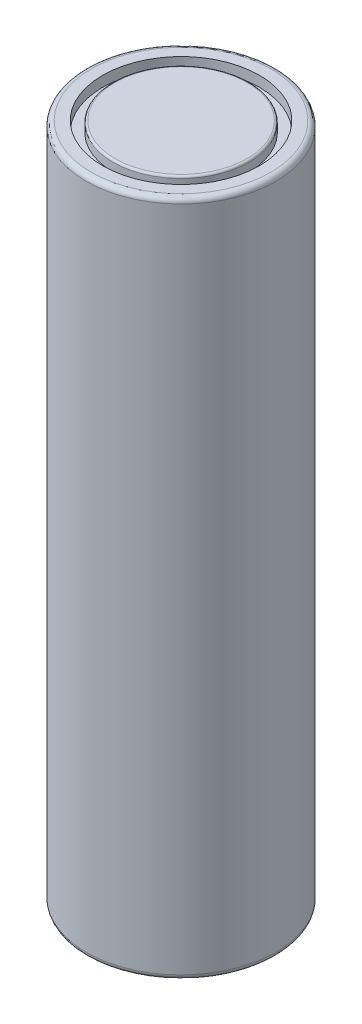
ISO-10303-21;
HEADER;
FILE_DESCRIPTION(('STEP AP214'),'2;1');
FILE_NAME('part.step','',(''),(''),'','','');
FILE_SCHEMA(('AUTOMOTIVE_DESIGN { 1 0 10303 214 1 1 1 1 }'));
ENDSEC;
DATA;
#1=APPLICATION_CONTEXT('core data for automotive mechanical design processes');
#2=APPLICATION_PROTOCOL_DEFINITION('international standard','automotive_design',2000,#1);
#3=PRODUCT_CONTEXT('',#1,'mechanical');
#4=PRODUCT('Part','Part','',(#3));
#5=PRODUCT_RELATED_PRODUCT_CATEGORY('part','',(#4));
#6=PRODUCT_DEFINITION_FORMATION('','',#4);
#7=PRODUCT_DEFINITION_CONTEXT('part definition',#1,'design');
#8=PRODUCT_DEFINITION('design','',#6,#7);
#9=PRODUCT_DEFINITION_SHAPE('','',#8);
#10=(LENGTH_UNIT() NAMED_UNIT(*) SI_UNIT(.MILLI.,.METRE.));
#11=(NAMED_UNIT(*) PLANE_ANGLE_UNIT() SI_UNIT($,.RADIAN.));
#12=(NAMED_UNIT(*) SI_UNIT($,.STERADIAN.) SOLID_ANGLE_UNIT());
#13=UNCERTAINTY_MEASURE_WITH_UNIT(LENGTH_MEASURE(1.E-05),#10,'distance_accuracy_value','');
#14=(GEOMETRIC_REPRESENTATION_CONTEXT(3) GLOBAL_UNCERTAINTY_ASSIGNED_CONTEXT((#13)) GLOBAL_UNIT_ASSIGNED_CONTEXT((#10,
#11,#12)) REPRESENTATION_CONTEXT('',''));
#15=CARTESIAN_POINT('',(0.,0.,0.));
#16=DIRECTION('',(0.,0.,1.));
#17=DIRECTION('',(1.,0.,0.));
#18=AXIS2_PLACEMENT_3D('',#15,#16,#17);
#19=CARTESIAN_POINT('',(0.,65.,0.));
#20=DIRECTION('',(0.,-1.,0.));
#21=DIRECTION('',(0.,0.,-1.));
#22=AXIS2_PLACEMENT_3D('',#19,#20,#21);
#23=CYLINDRICAL_SURFACE('',#22,9.1);
#24=CARTESIAN_POINT('',(0.,0.5,0.));
#25=DIRECTION('',(0.,1.,0.));
#26=DIRECTION('',(0.,0.,1.));
#27=AXIS2_PLACEMENT_3D('',#24,#25,#26);
#28=CIRCLE('',#27,9.1);
#29=CARTESIAN_POINT('',(0.,0.5,9.10000000000002));
#30=VERTEX_POINT('',#29);
#31=EDGE_CURVE('E99',#30,#30,#28,.T.);
#32=ORIENTED_EDGE('',*,*,#31,.T.);
#33=EDGE_LOOP('',(#32));
#34=FACE_BOUND('',#33,.T.);
#35=CARTESIAN_POINT('',(0.,64.5,0.));
#36=DIRECTION('',(0.,1.,0.));
#37=DIRECTION('',(0.,0.,1.));
#38=AXIS2_PLACEMENT_3D('',#35,#36,#37);
#39=CIRCLE('',#38,9.1);
#40=CARTESIAN_POINT('',(0.,64.5,9.10000000000002));
#41=VERTEX_POINT('',#40);
#42=EDGE_CURVE('E103',#41,#41,#39,.F.);
#43=ORIENTED_EDGE('',*,*,#42,.T.);
#44=EDGE_LOOP('',(#43));
#45=FACE_BOUND('',#44,.T.);
#46=ADVANCED_FACE('F63',(#34,#45),#23,.T.);
#47=CARTESIAN_POINT('',(0.,65.,0.));
#48=DIRECTION('',(0.,1.,0.));
#49=DIRECTION('',(0.,0.,1.));
#50=AXIS2_PLACEMENT_3D('',#47,#48,#49);
#51=PLANE('',#50);
#52=CARTESIAN_POINT('',(0.,65.,0.));
#53=DIRECTION('',(0.,1.,0.));
#54=DIRECTION('',(0.,0.,1.));
#55=AXIS2_PLACEMENT_3D('',#52,#53,#54);
#56=CIRCLE('',#55,8.6);
#57=CARTESIAN_POINT('',(0.,65.,8.60000000000002));
#58=VERTEX_POINT('',#57);
#59=EDGE_CURVE('E91',#58,#58,#56,.T.);
#60=ORIENTED_EDGE('',*,*,#59,.T.);
#61=EDGE_LOOP('',(#60));
#62=FACE_BOUND('',#61,.T.);
#63=CARTESIAN_POINT('',(0.,65.,0.));
#64=DIRECTION('',(0.,1.,0.));
#65=DIRECTION('',(0.,0.,1.));
#66=AXIS2_PLACEMENT_3D('',#63,#64,#65);
#67=CIRCLE('',#66,7.51581654783285);
#68=CARTESIAN_POINT('',(0.,65.,7.51581654783286));
#69=VERTEX_POINT('',#68);
#70=EDGE_CURVE('E108',#69,#69,#67,.T.);
#71=ORIENTED_EDGE('',*,*,#70,.F.);
#72=EDGE_LOOP('',(#71));
#73=FACE_BOUND('',#72,.T.);
#74=ADVANCED_FACE('F153',(#62,#73),#51,.T.);
#75=CARTESIAN_POINT('',(0.,0.,0.));
#76=DIRECTION('',(0.,1.,0.));
#77=DIRECTION('',(0.,0.,1.));
#78=AXIS2_PLACEMENT_3D('',#75,#76,#77);
#79=PLANE('',#78);
#80=CARTESIAN_POINT('',(0.,0.,0.));
#81=DIRECTION('',(0.,-1.,0.));
#82=DIRECTION('',(0.,0.,-1.));
#83=AXIS2_PLACEMENT_3D('',#80,#81,#82);
#84=CIRCLE('',#83,7.51581654783285);
#85=CARTESIAN_POINT('',(0.,0.,-7.51581654783286));
#86=VERTEX_POINT('',#85);
#87=EDGE_CURVE('E120',#86,#86,#84,.T.);
#88=ORIENTED_EDGE('',*,*,#87,.F.);
#89=EDGE_LOOP('',(#88));
#90=FACE_BOUND('',#89,.T.);
#91=CARTESIAN_POINT('',(0.,0.,0.));
#92=DIRECTION('',(0.,1.,0.));
#93=DIRECTION('',(0.,0.,1.));
#94=AXIS2_PLACEMENT_3D('',#91,#92,#93);
#95=CIRCLE('',#94,8.6);
#96=CARTESIAN_POINT('',(0.,0.,8.60000000000002));
#97=VERTEX_POINT('',#96);
#98=EDGE_CURVE('E95',#97,#97,#95,.F.);
#99=ORIENTED_EDGE('',*,*,#98,.T.);
#100=EDGE_LOOP('',(#99));
#101=FACE_BOUND('',#100,.T.);
#102=ADVANCED_FACE('F149',(#90,#101),#79,.F.);
#103=CARTESIAN_POINT('',(0.,64.,0.));
#104=DIRECTION('',(0.,1.,0.));
#105=DIRECTION('',(0.,0.,1.));
#106=AXIS2_PLACEMENT_3D('',#103,#104,#105);
#107=CYLINDRICAL_SURFACE('',#106,7.51581654783285);
#108=CARTESIAN_POINT('',(0.,64.,0.));
#109=DIRECTION('',(0.,1.,0.));
#110=DIRECTION('',(0.,0.,1.));
#111=AXIS2_PLACEMENT_3D('',#108,#109,#110);
#112=CIRCLE('',#111,7.51581654783285);
#113=CARTESIAN_POINT('',(0.,64.,7.51581654783286));
#114=VERTEX_POINT('',#113);
#115=EDGE_CURVE('E107',#114,#114,#112,.T.);
#116=ORIENTED_EDGE('',*,*,#115,.F.);
#117=EDGE_LOOP('',(#116));
#118=FACE_BOUND('',#117,.T.);
#119=ORIENTED_EDGE('',*,*,#70,.T.);
#120=EDGE_LOOP('',(#119));
#121=FACE_BOUND('',#120,.T.);
#122=ADVANCED_FACE('F152',(#118,#121),#107,.F.);
#123=CARTESIAN_POINT('',(0.,64.,0.));
#124=DIRECTION('',(0.,1.,0.));
#125=DIRECTION('',(0.,0.,1.));
#126=AXIS2_PLACEMENT_3D('',#123,#124,#125);
#127=PLANE('',#126);
#128=CARTESIAN_POINT('',(0.,64.,0.));
#129=DIRECTION('',(0.,1.,0.));
#130=DIRECTION('',(0.,0.,1.));
#131=AXIS2_PLACEMENT_3D('',#128,#129,#130);
#132=CIRCLE('',#131,6.52806202223023);
#133=CARTESIAN_POINT('',(0.,64.,6.52806202223024));
#134=VERTEX_POINT('',#133);
#135=EDGE_CURVE('E112',#134,#134,#132,.T.);
#136=ORIENTED_EDGE('',*,*,#135,.F.);
#137=EDGE_LOOP('',(#136));
#138=FACE_BOUND('',#137,.T.);
#139=ORIENTED_EDGE('',*,*,#115,.T.);
#140=EDGE_LOOP('',(#139));
#141=FACE_BOUND('',#140,.T.);
#142=ADVANCED_FACE('F181',(#138,#141),#127,.T.);
#143=CARTESIAN_POINT('',(0.,64.,0.));
#144=DIRECTION('',(0.,1.,0.));
#145=DIRECTION('',(0.,0.,1.));
#146=AXIS2_PLACEMENT_3D('',#143,#144,#145);
#147=CYLINDRICAL_SURFACE('',#146,6.52806202223023);
#148=CARTESIAN_POINT('',(0.,64.8,0.));
#149=DIRECTION('',(0.,1.,0.));
#150=DIRECTION('',(0.,0.,1.));
#151=AXIS2_PLACEMENT_3D('',#148,#149,#150);
#152=CIRCLE('',#151,6.52806202223023);
#153=CARTESIAN_POINT('',(0.,64.8,6.52806202223024));
#154=VERTEX_POINT('',#153);
#155=EDGE_CURVE('E12',#154,#154,#152,.F.);
#156=ORIENTED_EDGE('',*,*,#155,.T.);
#157=EDGE_LOOP('',(#156));
#158=FACE_BOUND('',#157,.T.);
#159=ORIENTED_EDGE('',*,*,#135,.T.);
#160=EDGE_LOOP('',(#159));
#161=FACE_BOUND('',#160,.T.);
#162=ADVANCED_FACE('F187',(#158,#161),#147,.T.);
#163=CARTESIAN_POINT('',(0.,65.,0.));
#164=DIRECTION('',(0.,1.,0.));
#165=DIRECTION('',(0.,0.,1.));
#166=AXIS2_PLACEMENT_3D('',#163,#164,#165);
#167=CIRCLE('',#166,6.32806202223023);
#168=CARTESIAN_POINT('',(0.,65.,6.32806202223024));
#169=VERTEX_POINT('',#168);
#170=EDGE_CURVE('E71',#169,#169,#167,.T.);
#171=ORIENTED_EDGE('',*,*,#170,.T.);
#172=EDGE_LOOP('',(#171));
#173=FACE_BOUND('',#172,.T.);
#174=ADVANCED_FACE('F161',(#173),#51,.T.);
#175=CARTESIAN_POINT('',(0.,0.5,0.));
#176=DIRECTION('',(0.,1.,0.));
#177=DIRECTION('',(0.,0.,1.));
#178=AXIS2_PLACEMENT_3D('',#175,#176,#177);
#179=TOROIDAL_SURFACE('',#178,8.6,0.5);
#180=ORIENTED_EDGE('',*,*,#98,.F.);
#181=EDGE_LOOP('',(#180));
#182=FACE_BOUND('',#181,.T.);
#183=ORIENTED_EDGE('',*,*,#31,.F.);
#184=EDGE_LOOP('',(#183));
#185=FACE_BOUND('',#184,.T.);
#186=ADVANCED_FACE('F158',(#182,#185),#179,.T.);
#187=CARTESIAN_POINT('',(0.,64.5,0.));
#188=DIRECTION('',(0.,1.,0.));
#189=DIRECTION('',(0.,0.,1.));
#190=AXIS2_PLACEMENT_3D('',#187,#188,#189);
#191=TOROIDAL_SURFACE('',#190,8.6,0.5);
#192=ORIENTED_EDGE('',*,*,#42,.F.);
#193=EDGE_LOOP('',(#192));
#194=FACE_BOUND('',#193,.T.);
#195=ORIENTED_EDGE('',*,*,#59,.F.);
#196=EDGE_LOOP('',(#195));
#197=FACE_BOUND('',#196,.T.);
#198=ADVANCED_FACE('F145',(#194,#197),#191,.T.);
#199=CARTESIAN_POINT('',(0.,1.,0.));
#200=DIRECTION('',(0.,-1.,0.));
#201=DIRECTION('',(0.,0.,-1.));
#202=AXIS2_PLACEMENT_3D('',#199,#200,#201);
#203=CYLINDRICAL_SURFACE('',#202,7.51581654783285);
#204=CARTESIAN_POINT('',(0.,1.,0.));
#205=DIRECTION('',(0.,-1.,0.));
#206=DIRECTION('',(0.,0.,-1.));
#207=AXIS2_PLACEMENT_3D('',#204,#205,#206);
#208=CIRCLE('',#207,7.51581654783285);
#209=CARTESIAN_POINT('',(0.,1.,-7.51581654783286));
#210=VERTEX_POINT('',#209);
#211=EDGE_CURVE('E119',#210,#210,#208,.T.);
#212=ORIENTED_EDGE('',*,*,#211,.F.);
#213=EDGE_LOOP('',(#212));
#214=FACE_BOUND('',#213,.T.);
#215=ORIENTED_EDGE('',*,*,#87,.T.);
#216=EDGE_LOOP('',(#215));
#217=FACE_BOUND('',#216,.T.);
#218=ADVANCED_FACE('F139',(#214,#217),#203,.F.);
#219=CARTESIAN_POINT('',(0.,1.,0.));
#220=DIRECTION('',(0.,-1.,0.));
#221=DIRECTION('',(0.,0.,-1.));
#222=AXIS2_PLACEMENT_3D('',#219,#220,#221);
#223=PLANE('',#222);
#224=CARTESIAN_POINT('',(0.,1.,0.));
#225=DIRECTION('',(0.,-1.,0.));
#226=DIRECTION('',(0.,0.,-1.));
#227=AXIS2_PLACEMENT_3D('',#224,#225,#226);
#228=CIRCLE('',#227,6.52806202223023);
#229=CARTESIAN_POINT('',(0.,1.,-6.52806202223024));
#230=VERTEX_POINT('',#229);
#231=EDGE_CURVE('E124',#230,#230,#228,.T.);
#232=ORIENTED_EDGE('',*,*,#231,.F.);
#233=EDGE_LOOP('',(#232));
#234=FACE_BOUND('',#233,.T.);
#235=ORIENTED_EDGE('',*,*,#211,.T.);
#236=EDGE_LOOP('',(#235));
#237=FACE_BOUND('',#236,.T.);
#238=ADVANCED_FACE('F136',(#234,#237),#223,.T.);
#239=CARTESIAN_POINT('',(0.,1.,0.));
#240=DIRECTION('',(0.,-1.,0.));
#241=DIRECTION('',(0.,0.,-1.));
#242=AXIS2_PLACEMENT_3D('',#239,#240,#241);
#243=CYLINDRICAL_SURFACE('',#242,6.52806202223023);
#244=CARTESIAN_POINT('',(0.,0.199999999999999,0.));
#245=DIRECTION('',(0.,1.,0.));
#246=DIRECTION('',(0.,0.,1.));
#247=AXIS2_PLACEMENT_3D('',#244,#245,#246);
#248=CIRCLE('',#247,6.52806202223023);
#249=CARTESIAN_POINT('',(0.,0.199999999999999,6.52806202223024));
#250=VERTEX_POINT('',#249);
#251=EDGE_CURVE('E78',#250,#250,#248,.T.);
#252=ORIENTED_EDGE('',*,*,#251,.T.);
#253=EDGE_LOOP('',(#252));
#254=FACE_BOUND('',#253,.T.);
#255=ORIENTED_EDGE('',*,*,#231,.T.);
#256=EDGE_LOOP('',(#255));
#257=FACE_BOUND('',#256,.T.);
#258=ADVANCED_FACE('F134',(#254,#257),#243,.T.);
#259=CARTESIAN_POINT('',(0.,0.,0.));
#260=DIRECTION('',(0.,1.,0.));
#261=DIRECTION('',(0.,0.,1.));
#262=AXIS2_PLACEMENT_3D('',#259,#260,#261);
#263=CIRCLE('',#262,6.32806202223023);
#264=CARTESIAN_POINT('',(0.,0.,6.32806202223024));
#265=VERTEX_POINT('',#264);
#266=EDGE_CURVE('E85',#265,#265,#263,.F.);
#267=ORIENTED_EDGE('',*,*,#266,.T.);
#268=EDGE_LOOP('',(#267));
#269=FACE_BOUND('',#268,.T.);
#270=ADVANCED_FACE('F155',(#269),#79,.F.);
#271=CARTESIAN_POINT('',(0.,0.199999999999999,0.));
#272=DIRECTION('',(0.,1.,0.));
#273=DIRECTION('',(0.,0.,1.));
#274=AXIS2_PLACEMENT_3D('',#271,#272,#273);
#275=TOROIDAL_SURFACE('',#274,6.32806202223023,0.2);
#276=ORIENTED_EDGE('',*,*,#251,.F.);
#277=EDGE_LOOP('',(#276));
#278=FACE_BOUND('',#277,.T.);
#279=ORIENTED_EDGE('',*,*,#266,.F.);
#280=EDGE_LOOP('',(#279));
#281=FACE_BOUND('',#280,.T.);
#282=ADVANCED_FACE('F192',(#278,#281),#275,.T.);
#283=CARTESIAN_POINT('',(0.,64.8,0.));
#284=DIRECTION('',(0.,1.,0.));
#285=DIRECTION('',(0.,0.,1.));
#286=AXIS2_PLACEMENT_3D('',#283,#284,#285);
#287=TOROIDAL_SURFACE('',#286,6.32806202223023,0.2);
#288=ORIENTED_EDGE('',*,*,#155,.F.);
#289=EDGE_LOOP('',(#288));
#290=FACE_BOUND('',#289,.T.);
#291=ORIENTED_EDGE('',*,*,#170,.F.);
#292=EDGE_LOOP('',(#291));
#293=FACE_BOUND('',#292,.T.);
#294=ADVANCED_FACE('F65',(#290,#293),#287,.T.);
#295=CLOSED_SHELL('',(#46,#74,#102,#122,#142,#162,#174,#186,#198,#218,#238,#258,#270,#282,#294));
#296=MANIFOLD_SOLID_BREP('B2',#295);
#297=ADVANCED_BREP_SHAPE_REPRESENTATION('',(#18,#296),#14);
#298=SHAPE_DEFINITION_REPRESENTATION(#9,#297);
ENDSEC;
END-ISO-10303-21;
